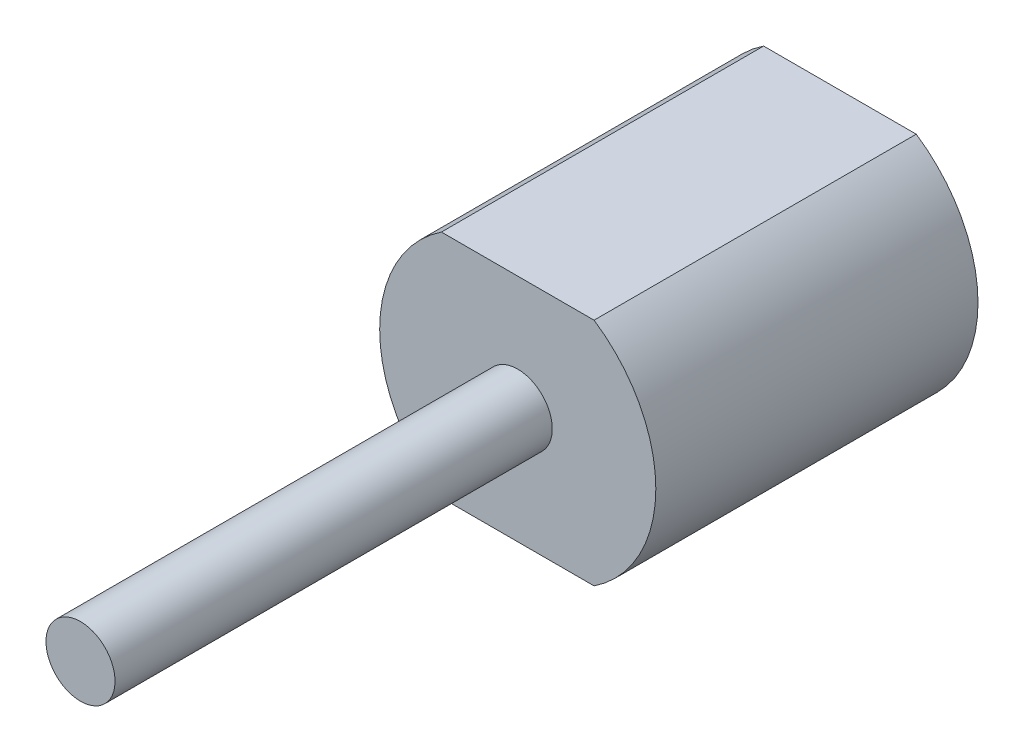
ISO-10303-21;
HEADER;
FILE_DESCRIPTION(('STEP AP214'),'2;1');
FILE_NAME('part.step','',(''),(''),'','','');
FILE_SCHEMA(('AUTOMOTIVE_DESIGN { 1 0 10303 214 1 1 1 1 }'));
ENDSEC;
DATA;
#1=APPLICATION_CONTEXT('core data for automotive mechanical design processes');
#2=APPLICATION_PROTOCOL_DEFINITION('international standard','automotive_design',2000,#1);
#3=PRODUCT_CONTEXT('',#1,'mechanical');
#4=PRODUCT('Part','Part','',(#3));
#5=PRODUCT_RELATED_PRODUCT_CATEGORY('part','',(#4));
#6=PRODUCT_DEFINITION_FORMATION('','',#4);
#7=PRODUCT_DEFINITION_CONTEXT('part definition',#1,'design');
#8=PRODUCT_DEFINITION('design','',#6,#7);
#9=PRODUCT_DEFINITION_SHAPE('','',#8);
#10=(LENGTH_UNIT() NAMED_UNIT(*) SI_UNIT(.MILLI.,.METRE.));
#11=(NAMED_UNIT(*) PLANE_ANGLE_UNIT() SI_UNIT($,.RADIAN.));
#12=(NAMED_UNIT(*) SI_UNIT($,.STERADIAN.) SOLID_ANGLE_UNIT());
#13=UNCERTAINTY_MEASURE_WITH_UNIT(LENGTH_MEASURE(1.E-05),#10,'distance_accuracy_value','');
#14=(GEOMETRIC_REPRESENTATION_CONTEXT(3) GLOBAL_UNCERTAINTY_ASSIGNED_CONTEXT((#13)) GLOBAL_UNIT_ASSIGNED_CONTEXT((#10,
#11,#12)) REPRESENTATION_CONTEXT('',''));
#15=CARTESIAN_POINT('',(0.,0.,0.));
#16=DIRECTION('',(0.,0.,1.));
#17=DIRECTION('',(1.,0.,0.));
#18=AXIS2_PLACEMENT_3D('',#15,#16,#17);
#19=CARTESIAN_POINT('',(-3.316624790358,-4.999999999999,0.));
#20=DIRECTION('',(0.,0.,-1.));
#21=DIRECTION('',(0.,1.,0.));
#22=AXIS2_PLACEMENT_3D('',#19,#20,#21);
#23=PLANE('',#22);
#24=CARTESIAN_POINT('',(0.,0.,0.));
#25=DIRECTION('',(0.,0.,-1.));
#26=DIRECTION('',(0.,1.,0.));
#27=AXIS2_PLACEMENT_3D('',#24,#25,#26);
#28=CIRCLE('',#27,6.);
#29=CARTESIAN_POINT('',(3.31662479035659,-4.99999999999921,0.));
#30=VERTEX_POINT('',#29);
#31=CARTESIAN_POINT('',(3.31662479035694,4.99999999999898,0.));
#32=VERTEX_POINT('',#31);
#33=EDGE_CURVE('E61',#30,#32,#28,.F.);
#34=ORIENTED_EDGE('',*,*,#33,.F.);
#35=DIRECTION('',(1.,0.,0.));
#36=VECTOR('',#35,1.);
#37=CARTESIAN_POINT('',(-3.316624790358,-4.999999999999,0.));
#38=LINE('',#37,#36);
#39=CARTESIAN_POINT('',(-3.31662479035729,-4.99999999999875,0.));
#40=VERTEX_POINT('',#39);
#41=EDGE_CURVE('E58',#30,#40,#38,.F.);
#42=ORIENTED_EDGE('',*,*,#41,.T.);
#43=CARTESIAN_POINT('',(0.,0.,0.));
#44=DIRECTION('',(0.,0.,-1.));
#45=DIRECTION('',(0.,1.,0.));
#46=AXIS2_PLACEMENT_3D('',#43,#44,#45);
#47=CIRCLE('',#46,6.);
#48=CARTESIAN_POINT('',(-3.31662479035595,4.999999999999,0.));
#49=VERTEX_POINT('',#48);
#50=EDGE_CURVE('E20',#49,#40,#47,.F.);
#51=ORIENTED_EDGE('',*,*,#50,.F.);
#52=DIRECTION('',(1.,0.,0.));
#53=VECTOR('',#52,1.);
#54=CARTESIAN_POINT('',(3.316624790357,4.999999999999,0.));
#55=LINE('',#54,#53);
#56=EDGE_CURVE('E77',#49,#32,#55,.T.);
#57=ORIENTED_EDGE('',*,*,#56,.T.);
#58=EDGE_LOOP('',(#34,#42,#51,#57));
#59=FACE_BOUND('',#58,.T.);
#60=ADVANCED_FACE('F17',(#59),#23,.T.);
#61=CARTESIAN_POINT('',(-3.316624790358,-4.999999999999,0.));
#62=DIRECTION('',(0.,1.,0.));
#63=DIRECTION('',(0.,0.,1.));
#64=AXIS2_PLACEMENT_3D('',#61,#62,#63);
#65=PLANE('',#64);
#66=DIRECTION('',(0.,0.,-1.));
#67=VECTOR('',#66,1.);
#68=CARTESIAN_POINT('',(3.31662479035628,-4.99999999999942,0.));
#69=LINE('',#68,#67);
#70=CARTESIAN_POINT('',(3.31662479035659,-4.99999999999921,14.));
#71=VERTEX_POINT('',#70);
#72=EDGE_CURVE('E89',#71,#30,#69,.T.);
#73=ORIENTED_EDGE('',*,*,#72,.F.);
#74=DIRECTION('',(1.,0.,0.));
#75=VECTOR('',#74,1.);
#76=CARTESIAN_POINT('',(-3.316624790358,-4.999999999999,14.));
#77=LINE('',#76,#75);
#78=CARTESIAN_POINT('',(-3.31662479035728,-4.99999999999875,14.));
#79=VERTEX_POINT('',#78);
#80=EDGE_CURVE('E69',#71,#79,#77,.F.);
#81=ORIENTED_EDGE('',*,*,#80,.T.);
#82=DIRECTION('',(0.,0.,-1.));
#83=VECTOR('',#82,1.);
#84=CARTESIAN_POINT('',(-3.31662479035766,-4.9999999999985,0.));
#85=LINE('',#84,#83);
#86=EDGE_CURVE('E66',#40,#79,#85,.F.);
#87=ORIENTED_EDGE('',*,*,#86,.F.);
#88=ORIENTED_EDGE('',*,*,#41,.F.);
#89=EDGE_LOOP('',(#73,#81,#87,#88));
#90=FACE_BOUND('',#89,.T.);
#91=ADVANCED_FACE('F67',(#90),#65,.F.);
#92=CARTESIAN_POINT('',(0.,0.,0.));
#93=DIRECTION('',(0.,0.,-1.));
#94=DIRECTION('',(0.,1.,0.));
#95=AXIS2_PLACEMENT_3D('',#92,#93,#94);
#96=CYLINDRICAL_SURFACE('',#95,6.);
#97=CARTESIAN_POINT('',(0.,0.,14.));
#98=DIRECTION('',(0.,0.,-1.));
#99=DIRECTION('',(0.,1.,0.));
#100=AXIS2_PLACEMENT_3D('',#97,#98,#99);
#101=CIRCLE('',#100,6.);
#102=CARTESIAN_POINT('',(-3.3166247903552,4.9999999999995,14.));
#103=VERTEX_POINT('',#102);
#104=EDGE_CURVE('E76',#79,#103,#101,.T.);
#105=ORIENTED_EDGE('',*,*,#104,.T.);
#106=DIRECTION('',(0.,0.,-1.));
#107=VECTOR('',#106,1.);
#108=CARTESIAN_POINT('',(-3.316624790355,4.999999999999,0.));
#109=LINE('',#108,#107);
#110=EDGE_CURVE('E72',#103,#49,#109,.T.);
#111=ORIENTED_EDGE('',*,*,#110,.T.);
#112=ORIENTED_EDGE('',*,*,#50,.T.);
#113=ORIENTED_EDGE('',*,*,#86,.T.);
#114=EDGE_LOOP('',(#105,#111,#112,#113));
#115=FACE_BOUND('',#114,.T.);
#116=ADVANCED_FACE('F74',(#115),#96,.T.);
#117=CARTESIAN_POINT('',(3.316624790357,4.999999999999,0.));
#118=DIRECTION('',(0.,-1.,0.));
#119=DIRECTION('',(0.,0.,-1.));
#120=AXIS2_PLACEMENT_3D('',#117,#118,#119);
#121=PLANE('',#120);
#122=ORIENTED_EDGE('',*,*,#110,.F.);
#123=DIRECTION('',(1.,0.,0.));
#124=VECTOR('',#123,1.);
#125=CARTESIAN_POINT('',(-3.316624790358,5.,14.));
#126=LINE('',#125,#124);
#127=CARTESIAN_POINT('',(3.31662479035619,4.99999999999948,14.));
#128=VERTEX_POINT('',#127);
#129=EDGE_CURVE('E35',#103,#128,#126,.T.);
#130=ORIENTED_EDGE('',*,*,#129,.T.);
#131=DIRECTION('',(0.,0.,-1.));
#132=VECTOR('',#131,1.);
#133=CARTESIAN_POINT('',(3.31662479035697,4.99999999999896,0.));
#134=LINE('',#133,#132);
#135=EDGE_CURVE('E80',#32,#128,#134,.F.);
#136=ORIENTED_EDGE('',*,*,#135,.F.);
#137=ORIENTED_EDGE('',*,*,#56,.F.);
#138=EDGE_LOOP('',(#122,#130,#136,#137));
#139=FACE_BOUND('',#138,.T.);
#140=ADVANCED_FACE('F79',(#139),#121,.F.);
#141=CARTESIAN_POINT('',(0.,0.,0.));
#142=DIRECTION('',(0.,0.,-1.));
#143=DIRECTION('',(0.,1.,0.));
#144=AXIS2_PLACEMENT_3D('',#141,#142,#143);
#145=CYLINDRICAL_SURFACE('',#144,6.);
#146=CARTESIAN_POINT('',(0.,0.,14.));
#147=DIRECTION('',(0.,0.,-1.));
#148=DIRECTION('',(0.,1.,0.));
#149=AXIS2_PLACEMENT_3D('',#146,#147,#148);
#150=CIRCLE('',#149,6.);
#151=EDGE_CURVE('E85',#128,#71,#150,.T.);
#152=ORIENTED_EDGE('',*,*,#151,.T.);
#153=ORIENTED_EDGE('',*,*,#72,.T.);
#154=ORIENTED_EDGE('',*,*,#33,.T.);
#155=ORIENTED_EDGE('',*,*,#135,.T.);
#156=EDGE_LOOP('',(#152,#153,#154,#155));
#157=FACE_BOUND('',#156,.T.);
#158=ADVANCED_FACE('F95',(#157),#145,.T.);
#159=CARTESIAN_POINT('',(1.5,0.,33.));
#160=DIRECTION('',(0.,0.,-1.));
#161=DIRECTION('',(0.,1.,0.));
#162=AXIS2_PLACEMENT_3D('',#159,#160,#161);
#163=PLANE('',#162);
#164=CARTESIAN_POINT('',(0.,0.,33.));
#165=DIRECTION('',(0.,0.,-1.));
#166=DIRECTION('',(0.,1.,0.));
#167=AXIS2_PLACEMENT_3D('',#164,#165,#166);
#168=CIRCLE('',#167,1.5);
#169=CARTESIAN_POINT('',(0.,1.50000000000001,33.));
#170=VERTEX_POINT('',#169);
#171=EDGE_CURVE('E26',#170,#170,#168,.T.);
#172=ORIENTED_EDGE('',*,*,#171,.F.);
#173=EDGE_LOOP('',(#172));
#174=FACE_BOUND('',#173,.T.);
#175=ADVANCED_FACE('F100',(#174),#163,.F.);
#176=CARTESIAN_POINT('',(-3.316624790358,-4.999999999999,14.));
#177=DIRECTION('',(0.,0.,-1.));
#178=DIRECTION('',(0.,1.,0.));
#179=AXIS2_PLACEMENT_3D('',#176,#177,#178);
#180=PLANE('',#179);
#181=CARTESIAN_POINT('',(0.,0.,14.));
#182=DIRECTION('',(0.,0.,-1.));
#183=DIRECTION('',(0.,1.,0.));
#184=AXIS2_PLACEMENT_3D('',#181,#182,#183);
#185=CIRCLE('',#184,1.5);
#186=CARTESIAN_POINT('',(0.,1.5,14.));
#187=VERTEX_POINT('',#186);
#188=EDGE_CURVE('E11',#187,#187,#185,.F.);
#189=ORIENTED_EDGE('',*,*,#188,.F.);
#190=EDGE_LOOP('',(#189));
#191=FACE_BOUND('',#190,.T.);
#192=ORIENTED_EDGE('',*,*,#129,.F.);
#193=ORIENTED_EDGE('',*,*,#104,.F.);
#194=ORIENTED_EDGE('',*,*,#80,.F.);
#195=ORIENTED_EDGE('',*,*,#151,.F.);
#196=EDGE_LOOP('',(#192,#193,#194,#195));
#197=FACE_BOUND('',#196,.T.);
#198=ADVANCED_FACE('F97',(#191,#197),#180,.F.);
#199=CARTESIAN_POINT('',(0.,0.,14.));
#200=DIRECTION('',(0.,0.,-1.));
#201=DIRECTION('',(0.,1.,0.));
#202=AXIS2_PLACEMENT_3D('',#199,#200,#201);
#203=CYLINDRICAL_SURFACE('',#202,1.5);
#204=ORIENTED_EDGE('',*,*,#171,.T.);
#205=EDGE_LOOP('',(#204));
#206=FACE_BOUND('',#205,.T.);
#207=ORIENTED_EDGE('',*,*,#188,.T.);
#208=EDGE_LOOP('',(#207));
#209=FACE_BOUND('',#208,.T.);
#210=ADVANCED_FACE('F99',(#206,#209),#203,.T.);
#211=CLOSED_SHELL('',(#60,#91,#116,#140,#158,#175,#198,#210));
#212=MANIFOLD_SOLID_BREP('B1',#211);
#213=ADVANCED_BREP_SHAPE_REPRESENTATION('',(#18,#212),#14);
#214=SHAPE_DEFINITION_REPRESENTATION(#9,#213);
ENDSEC;
END-ISO-10303-21;
